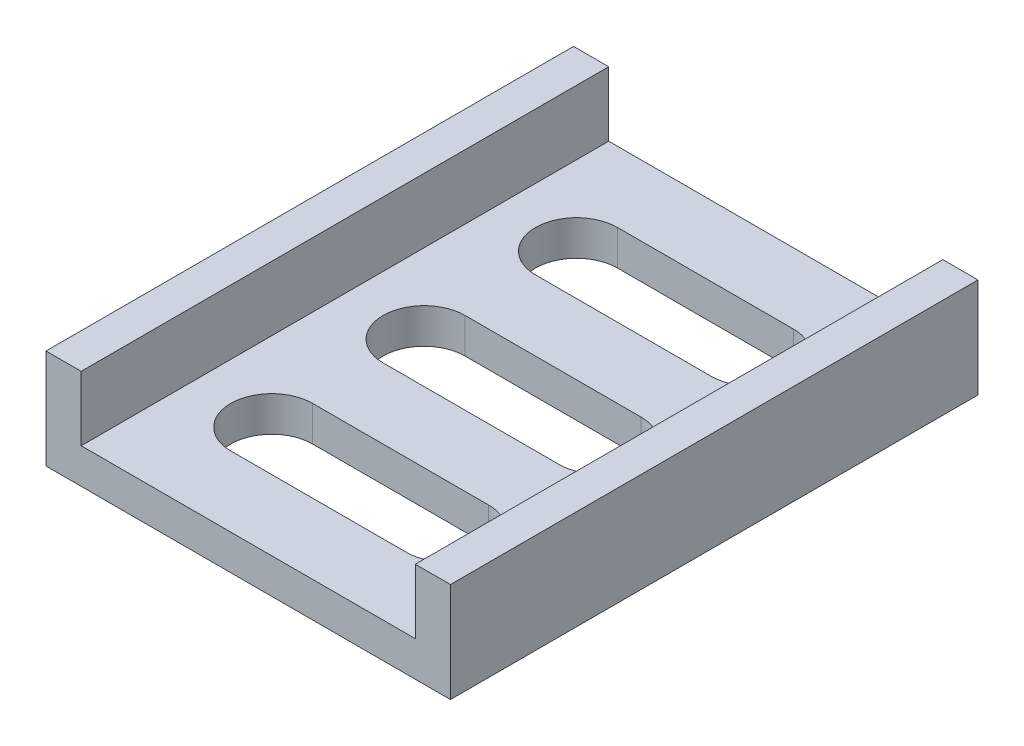
ISO-10303-21;
HEADER;
FILE_DESCRIPTION(('STEP AP214'),'2;1');
FILE_NAME('part.step','',(''),(''),'','','');
FILE_SCHEMA(('AUTOMOTIVE_DESIGN { 1 0 10303 214 1 1 1 1 }'));
ENDSEC;
DATA;
#1=APPLICATION_CONTEXT('core data for automotive mechanical design processes');
#2=APPLICATION_PROTOCOL_DEFINITION('international standard','automotive_design',2000,#1);
#3=PRODUCT_CONTEXT('',#1,'mechanical');
#4=PRODUCT('Part','Part','',(#3));
#5=PRODUCT_RELATED_PRODUCT_CATEGORY('part','',(#4));
#6=PRODUCT_DEFINITION_FORMATION('','',#4);
#7=PRODUCT_DEFINITION_CONTEXT('part definition',#1,'design');
#8=PRODUCT_DEFINITION('design','',#6,#7);
#9=PRODUCT_DEFINITION_SHAPE('','',#8);
#10=(LENGTH_UNIT() NAMED_UNIT(*) SI_UNIT(.MILLI.,.METRE.));
#11=(NAMED_UNIT(*) PLANE_ANGLE_UNIT() SI_UNIT($,.RADIAN.));
#12=(NAMED_UNIT(*) SI_UNIT($,.STERADIAN.) SOLID_ANGLE_UNIT());
#13=UNCERTAINTY_MEASURE_WITH_UNIT(LENGTH_MEASURE(1.E-05),#10,'distance_accuracy_value','');
#14=(GEOMETRIC_REPRESENTATION_CONTEXT(3) GLOBAL_UNCERTAINTY_ASSIGNED_CONTEXT((#13)) GLOBAL_UNIT_ASSIGNED_CONTEXT((#10,
#11,#12)) REPRESENTATION_CONTEXT('',''));
#15=CARTESIAN_POINT('',(0.,0.,0.));
#16=DIRECTION('',(0.,0.,1.));
#17=DIRECTION('',(1.,0.,0.));
#18=AXIS2_PLACEMENT_3D('',#15,#16,#17);
#19=CARTESIAN_POINT('',(17.25,0.,-22.5));
#20=DIRECTION('',(-1.,0.,0.));
#21=DIRECTION('',(0.,0.,1.));
#22=AXIS2_PLACEMENT_3D('',#19,#20,#21);
#23=PLANE('',#22);
#24=DIRECTION('',(0.,1.,0.));
#25=VECTOR('',#24,1.);
#26=CARTESIAN_POINT('',(17.25,4.25,-22.5));
#27=LINE('',#26,#25);
#28=CARTESIAN_POINT('',(17.25,0.,-22.5));
#29=VERTEX_POINT('',#28);
#30=CARTESIAN_POINT('',(17.25,8.5,-22.5));
#31=VERTEX_POINT('',#30);
#32=EDGE_CURVE('E270',#29,#31,#27,.T.);
#33=ORIENTED_EDGE('',*,*,#32,.T.);
#34=DIRECTION('',(0.,0.,1.));
#35=VECTOR('',#34,1.);
#36=CARTESIAN_POINT('',(17.25,8.5,0.));
#37=LINE('',#36,#35);
#38=CARTESIAN_POINT('',(17.25,8.5,22.5));
#39=VERTEX_POINT('',#38);
#40=EDGE_CURVE('E170',#31,#39,#37,.T.);
#41=ORIENTED_EDGE('',*,*,#40,.T.);
#42=DIRECTION('',(0.,-1.,0.));
#43=VECTOR('',#42,1.);
#44=CARTESIAN_POINT('',(17.25,4.25,22.5));
#45=LINE('',#44,#43);
#46=CARTESIAN_POINT('',(17.25,0.,22.5));
#47=VERTEX_POINT('',#46);
#48=EDGE_CURVE('E278',#39,#47,#45,.T.);
#49=ORIENTED_EDGE('',*,*,#48,.T.);
#50=DIRECTION('',(0.,0.,1.));
#51=VECTOR('',#50,1.);
#52=CARTESIAN_POINT('',(17.25,0.,0.));
#53=LINE('',#52,#51);
#54=EDGE_CURVE('E182',#29,#47,#53,.T.);
#55=ORIENTED_EDGE('',*,*,#54,.F.);
#56=EDGE_LOOP('',(#33,#41,#49,#55));
#57=FACE_BOUND('',#56,.T.);
#58=ADVANCED_FACE('F17',(#57),#23,.F.);
#59=CARTESIAN_POINT('',(-17.25,8.5,-22.5));
#60=DIRECTION('',(0.,1.,0.));
#61=DIRECTION('',(0.,0.,1.));
#62=AXIS2_PLACEMENT_3D('',#59,#60,#61);
#63=PLANE('',#62);
#64=DIRECTION('',(1.,0.,0.));
#65=VECTOR('',#64,1.);
#66=CARTESIAN_POINT('',(0.,8.5,22.5));
#67=LINE('',#66,#65);
#68=CARTESIAN_POINT('',(-17.25,8.5,22.5));
#69=VERTEX_POINT('',#68);
#70=CARTESIAN_POINT('',(-14.2499999955,8.5,22.5));
#71=VERTEX_POINT('',#70);
#72=EDGE_CURVE('E163',#69,#71,#67,.T.);
#73=ORIENTED_EDGE('',*,*,#72,.T.);
#74=DIRECTION('',(0.,0.,-1.));
#75=VECTOR('',#74,1.);
#76=CARTESIAN_POINT('',(-14.25,8.5,0.));
#77=LINE('',#76,#75);
#78=CARTESIAN_POINT('',(-14.24999999775,8.5,-22.5));
#79=VERTEX_POINT('',#78);
#80=EDGE_CURVE('E273',#71,#79,#77,.T.);
#81=ORIENTED_EDGE('',*,*,#80,.T.);
#82=DIRECTION('',(-1.,0.,0.));
#83=VECTOR('',#82,1.);
#84=CARTESIAN_POINT('',(0.,8.5,-22.5));
#85=LINE('',#84,#83);
#86=CARTESIAN_POINT('',(-17.25,8.5,-22.5));
#87=VERTEX_POINT('',#86);
#88=EDGE_CURVE('E166',#79,#87,#85,.T.);
#89=ORIENTED_EDGE('',*,*,#88,.T.);
#90=DIRECTION('',(0.,0.,1.));
#91=VECTOR('',#90,1.);
#92=CARTESIAN_POINT('',(-17.25,8.5,0.));
#93=LINE('',#92,#91);
#94=EDGE_CURVE('E161',#87,#69,#93,.T.);
#95=ORIENTED_EDGE('',*,*,#94,.T.);
#96=EDGE_LOOP('',(#73,#81,#89,#95));
#97=FACE_BOUND('',#96,.T.);
#98=ADVANCED_FACE('F162',(#97),#63,.T.);
#99=CARTESIAN_POINT('',(-17.25,0.,22.5));
#100=DIRECTION('',(1.,0.,0.));
#101=DIRECTION('',(0.,0.,-1.));
#102=AXIS2_PLACEMENT_3D('',#99,#100,#101);
#103=PLANE('',#102);
#104=DIRECTION('',(0.,1.,0.));
#105=VECTOR('',#104,1.);
#106=CARTESIAN_POINT('',(-17.25,4.25,22.5));
#107=LINE('',#106,#105);
#108=CARTESIAN_POINT('',(-17.25,0.,22.5));
#109=VERTEX_POINT('',#108);
#110=EDGE_CURVE('E156',#109,#69,#107,.T.);
#111=ORIENTED_EDGE('',*,*,#110,.T.);
#112=ORIENTED_EDGE('',*,*,#94,.F.);
#113=DIRECTION('',(0.,-1.,0.));
#114=VECTOR('',#113,1.);
#115=CARTESIAN_POINT('',(-17.25,4.25,-22.5));
#116=LINE('',#115,#114);
#117=CARTESIAN_POINT('',(-17.25,0.,-22.5));
#118=VERTEX_POINT('',#117);
#119=EDGE_CURVE('E262',#87,#118,#116,.T.);
#120=ORIENTED_EDGE('',*,*,#119,.T.);
#121=DIRECTION('',(0.,0.,-1.));
#122=VECTOR('',#121,1.);
#123=CARTESIAN_POINT('',(-17.25,0.,0.));
#124=LINE('',#123,#122);
#125=EDGE_CURVE('E179',#109,#118,#124,.T.);
#126=ORIENTED_EDGE('',*,*,#125,.F.);
#127=EDGE_LOOP('',(#111,#112,#120,#126));
#128=FACE_BOUND('',#127,.T.);
#129=ADVANCED_FACE('F178',(#128),#103,.F.);
#130=CARTESIAN_POINT('',(14.25,8.5,22.5));
#131=DIRECTION('',(0.,-1.,0.));
#132=DIRECTION('',(0.,0.,-1.));
#133=AXIS2_PLACEMENT_3D('',#130,#131,#132);
#134=PLANE('',#133);
#135=DIRECTION('',(0.,0.,1.));
#136=VECTOR('',#135,1.);
#137=CARTESIAN_POINT('',(14.25,8.5,0.));
#138=LINE('',#137,#136);
#139=CARTESIAN_POINT('',(14.2499999955,8.5,-22.5));
#140=VERTEX_POINT('',#139);
#141=CARTESIAN_POINT('',(14.24999999775,8.5,22.5));
#142=VERTEX_POINT('',#141);
#143=EDGE_CURVE('E253',#140,#142,#138,.T.);
#144=ORIENTED_EDGE('',*,*,#143,.T.);
#145=DIRECTION('',(1.,0.,0.));
#146=VECTOR('',#145,1.);
#147=CARTESIAN_POINT('',(0.,8.5,22.5));
#148=LINE('',#147,#146);
#149=EDGE_CURVE('E120',#142,#39,#148,.T.);
#150=ORIENTED_EDGE('',*,*,#149,.T.);
#151=ORIENTED_EDGE('',*,*,#40,.F.);
#152=DIRECTION('',(-1.,0.,0.));
#153=VECTOR('',#152,1.);
#154=CARTESIAN_POINT('',(0.,8.5,-22.5));
#155=LINE('',#154,#153);
#156=EDGE_CURVE('E268',#31,#140,#155,.T.);
#157=ORIENTED_EDGE('',*,*,#156,.T.);
#158=EDGE_LOOP('',(#144,#150,#151,#157));
#159=FACE_BOUND('',#158,.T.);
#160=ADVANCED_FACE('F281',(#159),#134,.F.);
#161=CARTESIAN_POINT('',(-17.25,0.,22.5));
#162=DIRECTION('',(0.,-1.,0.));
#163=DIRECTION('',(0.,0.,-1.));
#164=AXIS2_PLACEMENT_3D('',#161,#162,#163);
#165=PLANE('',#164);
#166=DIRECTION('',(-1.,0.,0.));
#167=VECTOR('',#166,1.);
#168=CARTESIAN_POINT('',(0.,0.,9.5));
#169=LINE('',#168,#167);
#170=CARTESIAN_POINT('',(7.5,0.,9.5));
#171=VERTEX_POINT('',#170);
#172=CARTESIAN_POINT('',(-7.50000000071786,0.,9.5));
#173=VERTEX_POINT('',#172);
#174=EDGE_CURVE('E192',#171,#173,#169,.T.);
#175=ORIENTED_EDGE('',*,*,#174,.T.);
#176=CARTESIAN_POINT('',(-7.5,0.,13.));
#177=DIRECTION('',(0.,1.,0.));
#178=DIRECTION('',(0.,0.,1.));
#179=AXIS2_PLACEMENT_3D('',#176,#177,#178);
#180=CIRCLE('',#179,3.5);
#181=CARTESIAN_POINT('',(-7.5,0.,16.5));
#182=VERTEX_POINT('',#181);
#183=EDGE_CURVE('E232',#182,#173,#180,.F.);
#184=ORIENTED_EDGE('',*,*,#183,.F.);
#185=DIRECTION('',(1.,0.,0.));
#186=VECTOR('',#185,1.);
#187=CARTESIAN_POINT('',(0.,0.,16.5));
#188=LINE('',#187,#186);
#189=CARTESIAN_POINT('',(7.5,0.,16.5));
#190=VERTEX_POINT('',#189);
#191=EDGE_CURVE('E186',#182,#190,#188,.T.);
#192=ORIENTED_EDGE('',*,*,#191,.T.);
#193=CARTESIAN_POINT('',(7.5,0.,13.));
#194=DIRECTION('',(0.,1.,0.));
#195=DIRECTION('',(0.,0.,1.));
#196=AXIS2_PLACEMENT_3D('',#193,#194,#195);
#197=CIRCLE('',#196,3.5);
#198=EDGE_CURVE('E200',#171,#190,#197,.F.);
#199=ORIENTED_EDGE('',*,*,#198,.F.);
#200=EDGE_LOOP('',(#175,#184,#192,#199));
#201=FACE_BOUND('',#200,.T.);
#202=DIRECTION('',(-1.,0.,0.));
#203=VECTOR('',#202,1.);
#204=CARTESIAN_POINT('',(0.,0.,-3.5));
#205=LINE('',#204,#203);
#206=CARTESIAN_POINT('',(7.5,0.,-3.5));
#207=VERTEX_POINT('',#206);
#208=CARTESIAN_POINT('',(-7.50000000071786,0.,-3.5));
#209=VERTEX_POINT('',#208);
#210=EDGE_CURVE('E202',#207,#209,#205,.T.);
#211=ORIENTED_EDGE('',*,*,#210,.T.);
#212=CARTESIAN_POINT('',(-7.5,0.,0.));
#213=DIRECTION('',(0.,1.,0.));
#214=DIRECTION('',(0.,0.,1.));
#215=AXIS2_PLACEMENT_3D('',#212,#213,#214);
#216=CIRCLE('',#215,3.5);
#217=CARTESIAN_POINT('',(-7.5,0.,3.5));
#218=VERTEX_POINT('',#217);
#219=EDGE_CURVE('E235',#218,#209,#216,.F.);
#220=ORIENTED_EDGE('',*,*,#219,.F.);
#221=DIRECTION('',(1.,0.,0.));
#222=VECTOR('',#221,1.);
#223=CARTESIAN_POINT('',(0.,0.,3.5));
#224=LINE('',#223,#222);
#225=CARTESIAN_POINT('',(7.5,0.,3.5));
#226=VERTEX_POINT('',#225);
#227=EDGE_CURVE('E197',#218,#226,#224,.T.);
#228=ORIENTED_EDGE('',*,*,#227,.T.);
#229=CARTESIAN_POINT('',(7.5,0.,0.));
#230=DIRECTION('',(0.,1.,0.));
#231=DIRECTION('',(0.,0.,1.));
#232=AXIS2_PLACEMENT_3D('',#229,#230,#231);
#233=CIRCLE('',#232,3.5);
#234=EDGE_CURVE('E238',#207,#226,#233,.F.);
#235=ORIENTED_EDGE('',*,*,#234,.F.);
#236=EDGE_LOOP('',(#211,#220,#228,#235));
#237=FACE_BOUND('',#236,.T.);
#238=CARTESIAN_POINT('',(-7.5,0.,-13.));
#239=DIRECTION('',(0.,1.,0.));
#240=DIRECTION('',(0.,0.,1.));
#241=AXIS2_PLACEMENT_3D('',#238,#239,#240);
#242=CIRCLE('',#241,3.5);
#243=CARTESIAN_POINT('',(-7.50000000031428,0.,-9.5));
#244=VERTEX_POINT('',#243);
#245=CARTESIAN_POINT('',(-7.50000000071786,0.,-16.5));
#246=VERTEX_POINT('',#245);
#247=EDGE_CURVE('E239',#244,#246,#242,.F.);
#248=ORIENTED_EDGE('',*,*,#247,.F.);
#249=DIRECTION('',(1.,0.,0.));
#250=VECTOR('',#249,1.);
#251=CARTESIAN_POINT('',(0.,0.,-9.5));
#252=LINE('',#251,#250);
#253=CARTESIAN_POINT('',(7.5,0.,-9.5));
#254=VERTEX_POINT('',#253);
#255=EDGE_CURVE('E207',#244,#254,#252,.T.);
#256=ORIENTED_EDGE('',*,*,#255,.T.);
#257=CARTESIAN_POINT('',(7.5,0.,-13.));
#258=DIRECTION('',(0.,1.,0.));
#259=DIRECTION('',(0.,0.,1.));
#260=AXIS2_PLACEMENT_3D('',#257,#258,#259);
#261=CIRCLE('',#260,3.5);
#262=CARTESIAN_POINT('',(7.5,0.,-16.5));
#263=VERTEX_POINT('',#262);
#264=EDGE_CURVE('E21',#263,#254,#261,.F.);
#265=ORIENTED_EDGE('',*,*,#264,.F.);
#266=DIRECTION('',(-1.,0.,0.));
#267=VECTOR('',#266,1.);
#268=CARTESIAN_POINT('',(0.,0.,-16.5));
#269=LINE('',#268,#267);
#270=EDGE_CURVE('E211',#263,#246,#269,.T.);
#271=ORIENTED_EDGE('',*,*,#270,.T.);
#272=EDGE_LOOP('',(#248,#256,#265,#271));
#273=FACE_BOUND('',#272,.T.);
#274=ORIENTED_EDGE('',*,*,#125,.T.);
#275=DIRECTION('',(1.,0.,0.));
#276=VECTOR('',#275,1.);
#277=CARTESIAN_POINT('',(0.,0.,-22.5));
#278=LINE('',#277,#276);
#279=EDGE_CURVE('E259',#118,#29,#278,.T.);
#280=ORIENTED_EDGE('',*,*,#279,.T.);
#281=ORIENTED_EDGE('',*,*,#54,.T.);
#282=DIRECTION('',(-1.,0.,0.));
#283=VECTOR('',#282,1.);
#284=CARTESIAN_POINT('',(0.,0.,22.5));
#285=LINE('',#284,#283);
#286=EDGE_CURVE('E276',#47,#109,#285,.T.);
#287=ORIENTED_EDGE('',*,*,#286,.T.);
#288=EDGE_LOOP('',(#274,#280,#281,#287));
#289=FACE_BOUND('',#288,.T.);
#290=ADVANCED_FACE('F352',(#201,#237,#273,#289),#165,.T.);
#291=CARTESIAN_POINT('',(17.25,0.,22.5));
#292=DIRECTION('',(0.,0.,-1.));
#293=DIRECTION('',(-1.,0.,0.));
#294=AXIS2_PLACEMENT_3D('',#291,#292,#293);
#295=PLANE('',#294);
#296=ORIENTED_EDGE('',*,*,#48,.F.);
#297=ORIENTED_EDGE('',*,*,#149,.F.);
#298=DIRECTION('',(0.,-1.,0.));
#299=VECTOR('',#298,1.);
#300=CARTESIAN_POINT('',(14.25,5.75,22.5));
#301=LINE('',#300,#299);
#302=CARTESIAN_POINT('',(14.2499999955,2.999999998,22.5));
#303=VERTEX_POINT('',#302);
#304=EDGE_CURVE('E210',#142,#303,#301,.T.);
#305=ORIENTED_EDGE('',*,*,#304,.T.);
#306=DIRECTION('',(-1.,0.,0.));
#307=VECTOR('',#306,1.);
#308=CARTESIAN_POINT('',(0.,3.,22.5));
#309=LINE('',#308,#307);
#310=CARTESIAN_POINT('',(-14.2499999955,2.999999998,22.5));
#311=VERTEX_POINT('',#310);
#312=EDGE_CURVE('E304',#303,#311,#309,.T.);
#313=ORIENTED_EDGE('',*,*,#312,.T.);
#314=DIRECTION('',(0.,1.,0.));
#315=VECTOR('',#314,1.);
#316=CARTESIAN_POINT('',(-14.25,5.75,22.5));
#317=LINE('',#316,#315);
#318=EDGE_CURVE('E176',#311,#71,#317,.T.);
#319=ORIENTED_EDGE('',*,*,#318,.T.);
#320=ORIENTED_EDGE('',*,*,#72,.F.);
#321=ORIENTED_EDGE('',*,*,#110,.F.);
#322=ORIENTED_EDGE('',*,*,#286,.F.);
#323=EDGE_LOOP('',(#296,#297,#305,#313,#319,#320,#321,#322));
#324=FACE_BOUND('',#323,.T.);
#325=ADVANCED_FACE('F173',(#324),#295,.F.);
#326=CARTESIAN_POINT('',(-14.25,3.,-22.5));
#327=DIRECTION('',(-1.,0.,0.));
#328=DIRECTION('',(0.,0.,1.));
#329=AXIS2_PLACEMENT_3D('',#326,#327,#328);
#330=PLANE('',#329);
#331=DIRECTION('',(0.,1.,0.));
#332=VECTOR('',#331,1.);
#333=CARTESIAN_POINT('',(-14.249999991,4.25,-22.5));
#334=LINE('',#333,#332);
#335=CARTESIAN_POINT('',(-14.24999999775,2.999999999,-22.5));
#336=VERTEX_POINT('',#335);
#337=EDGE_CURVE('E265',#336,#79,#334,.T.);
#338=ORIENTED_EDGE('',*,*,#337,.T.);
#339=ORIENTED_EDGE('',*,*,#80,.F.);
#340=ORIENTED_EDGE('',*,*,#318,.F.);
#341=DIRECTION('',(0.,0.,-1.));
#342=VECTOR('',#341,1.);
#343=CARTESIAN_POINT('',(-14.25,3.,0.));
#344=LINE('',#343,#342);
#345=EDGE_CURVE('E301',#311,#336,#344,.T.);
#346=ORIENTED_EDGE('',*,*,#345,.T.);
#347=EDGE_LOOP('',(#338,#339,#340,#346));
#348=FACE_BOUND('',#347,.T.);
#349=ADVANCED_FACE('F510',(#348),#330,.F.);
#350=CARTESIAN_POINT('',(-17.25,0.,-22.5));
#351=DIRECTION('',(0.,0.,1.));
#352=DIRECTION('',(1.,0.,0.));
#353=AXIS2_PLACEMENT_3D('',#350,#351,#352);
#354=PLANE('',#353);
#355=ORIENTED_EDGE('',*,*,#119,.F.);
#356=ORIENTED_EDGE('',*,*,#88,.F.);
#357=ORIENTED_EDGE('',*,*,#337,.F.);
#358=DIRECTION('',(1.,0.,0.));
#359=VECTOR('',#358,1.);
#360=CARTESIAN_POINT('',(0.,3.,-22.5));
#361=LINE('',#360,#359);
#362=CARTESIAN_POINT('',(14.2499999955,2.999999998,-22.5));
#363=VERTEX_POINT('',#362);
#364=EDGE_CURVE('E294',#336,#363,#361,.T.);
#365=ORIENTED_EDGE('',*,*,#364,.T.);
#366=DIRECTION('',(0.,1.,0.));
#367=VECTOR('',#366,1.);
#368=CARTESIAN_POINT('',(14.25,5.75,-22.5));
#369=LINE('',#368,#367);
#370=EDGE_CURVE('E256',#363,#140,#369,.T.);
#371=ORIENTED_EDGE('',*,*,#370,.T.);
#372=ORIENTED_EDGE('',*,*,#156,.F.);
#373=ORIENTED_EDGE('',*,*,#32,.F.);
#374=ORIENTED_EDGE('',*,*,#279,.F.);
#375=EDGE_LOOP('',(#355,#356,#357,#365,#371,#372,#373,#374));
#376=FACE_BOUND('',#375,.T.);
#377=ADVANCED_FACE('F291',(#376),#354,.F.);
#378=CARTESIAN_POINT('',(14.25,3.,22.5));
#379=DIRECTION('',(1.,0.,0.));
#380=DIRECTION('',(0.,0.,-1.));
#381=AXIS2_PLACEMENT_3D('',#378,#379,#380);
#382=PLANE('',#381);
#383=ORIENTED_EDGE('',*,*,#304,.F.);
#384=ORIENTED_EDGE('',*,*,#143,.F.);
#385=ORIENTED_EDGE('',*,*,#370,.F.);
#386=DIRECTION('',(0.,0.,1.));
#387=VECTOR('',#386,1.);
#388=CARTESIAN_POINT('',(14.25,3.,0.));
#389=LINE('',#388,#387);
#390=EDGE_CURVE('E300',#363,#303,#389,.T.);
#391=ORIENTED_EDGE('',*,*,#390,.T.);
#392=EDGE_LOOP('',(#383,#384,#385,#391));
#393=FACE_BOUND('',#392,.T.);
#394=ADVANCED_FACE('F286',(#393),#382,.F.);
#395=CARTESIAN_POINT('',(-7.5,0.,-9.5));
#396=DIRECTION('',(0.,0.,1.));
#397=DIRECTION('',(1.,0.,0.));
#398=AXIS2_PLACEMENT_3D('',#395,#396,#397);
#399=PLANE('',#398);
#400=DIRECTION('',(0.,1.,0.));
#401=VECTOR('',#400,1.);
#402=CARTESIAN_POINT('',(-7.50000000062855,1.5,-9.5));
#403=LINE('',#402,#401);
#404=CARTESIAN_POINT('',(-7.50000000031428,3.,-9.4999999975));
#405=VERTEX_POINT('',#404);
#406=EDGE_CURVE('E240',#405,#244,#403,.F.);
#407=ORIENTED_EDGE('',*,*,#406,.F.);
#408=DIRECTION('',(1.,0.,0.));
#409=VECTOR('',#408,1.);
#410=CARTESIAN_POINT('',(0.,3.,-9.499999995));
#411=LINE('',#410,#409);
#412=CARTESIAN_POINT('',(7.5,3.,-9.4999999975));
#413=VERTEX_POINT('',#412);
#414=EDGE_CURVE('E231',#405,#413,#411,.T.);
#415=ORIENTED_EDGE('',*,*,#414,.T.);
#416=DIRECTION('',(0.,-1.,0.));
#417=VECTOR('',#416,1.);
#418=CARTESIAN_POINT('',(7.5,1.5,-9.5));
#419=LINE('',#418,#417);
#420=EDGE_CURVE('E209',#254,#413,#419,.F.);
#421=ORIENTED_EDGE('',*,*,#420,.F.);
#422=ORIENTED_EDGE('',*,*,#255,.F.);
#423=EDGE_LOOP('',(#407,#415,#421,#422));
#424=FACE_BOUND('',#423,.T.);
#425=ADVANCED_FACE('F343',(#424),#399,.F.);
#426=CARTESIAN_POINT('',(7.5,0.,-13.));
#427=DIRECTION('',(0.,1.,0.));
#428=DIRECTION('',(0.,0.,1.));
#429=AXIS2_PLACEMENT_3D('',#426,#427,#428);
#430=CYLINDRICAL_SURFACE('',#429,3.5);
#431=DIRECTION('',(0.,-1.,0.));
#432=VECTOR('',#431,1.);
#433=CARTESIAN_POINT('',(7.5,1.5,-16.5));
#434=LINE('',#433,#432);
#435=CARTESIAN_POINT('',(7.5,3.,-16.5000000075));
#436=VERTEX_POINT('',#435);
#437=EDGE_CURVE('E214',#436,#263,#434,.T.);
#438=ORIENTED_EDGE('',*,*,#437,.T.);
#439=ORIENTED_EDGE('',*,*,#264,.T.);
#440=ORIENTED_EDGE('',*,*,#420,.T.);
#441=CARTESIAN_POINT('',(7.5,3.,-13.));
#442=DIRECTION('',(0.,1.,0.));
#443=DIRECTION('',(0.,0.,1.));
#444=AXIS2_PLACEMENT_3D('',#441,#442,#443);
#445=CIRCLE('',#444,3.5);
#446=EDGE_CURVE('E229',#413,#436,#445,.T.);
#447=ORIENTED_EDGE('',*,*,#446,.T.);
#448=EDGE_LOOP('',(#438,#439,#440,#447));
#449=FACE_BOUND('',#448,.T.);
#450=ADVANCED_FACE('F348',(#449),#430,.F.);
#451=CARTESIAN_POINT('',(7.5,0.,-16.5));
#452=DIRECTION('',(0.,0.,-1.));
#453=DIRECTION('',(-1.,0.,0.));
#454=AXIS2_PLACEMENT_3D('',#451,#452,#453);
#455=PLANE('',#454);
#456=DIRECTION('',(0.,-1.,0.));
#457=VECTOR('',#456,1.);
#458=CARTESIAN_POINT('',(-7.50000000143572,1.5,-16.5));
#459=LINE('',#458,#457);
#460=CARTESIAN_POINT('',(-7.50000000071786,3.,-16.5000000075));
#461=VERTEX_POINT('',#460);
#462=EDGE_CURVE('E213',#246,#461,#459,.F.);
#463=ORIENTED_EDGE('',*,*,#462,.F.);
#464=ORIENTED_EDGE('',*,*,#270,.F.);
#465=ORIENTED_EDGE('',*,*,#437,.F.);
#466=DIRECTION('',(-1.,0.,0.));
#467=VECTOR('',#466,1.);
#468=CARTESIAN_POINT('',(0.,3.,-16.500000015));
#469=LINE('',#468,#467);
#470=EDGE_CURVE('E228',#436,#461,#469,.T.);
#471=ORIENTED_EDGE('',*,*,#470,.T.);
#472=EDGE_LOOP('',(#463,#464,#465,#471));
#473=FACE_BOUND('',#472,.T.);
#474=ADVANCED_FACE('F351',(#473),#455,.F.);
#475=CARTESIAN_POINT('',(-7.5,0.,-13.));
#476=DIRECTION('',(0.,1.,0.));
#477=DIRECTION('',(0.,0.,1.));
#478=AXIS2_PLACEMENT_3D('',#475,#476,#477);
#479=CYLINDRICAL_SURFACE('',#478,3.5);
#480=ORIENTED_EDGE('',*,*,#247,.T.);
#481=ORIENTED_EDGE('',*,*,#462,.T.);
#482=CARTESIAN_POINT('',(-7.5,3.,-13.));
#483=DIRECTION('',(0.,1.,0.));
#484=DIRECTION('',(0.,0.,1.));
#485=AXIS2_PLACEMENT_3D('',#482,#483,#484);
#486=CIRCLE('',#485,3.5);
#487=EDGE_CURVE('E226',#461,#405,#486,.T.);
#488=ORIENTED_EDGE('',*,*,#487,.T.);
#489=ORIENTED_EDGE('',*,*,#406,.T.);
#490=EDGE_LOOP('',(#480,#481,#488,#489));
#491=FACE_BOUND('',#490,.T.);
#492=ADVANCED_FACE('F406',(#491),#479,.F.);
#493=CARTESIAN_POINT('',(7.5,0.,0.));
#494=DIRECTION('',(0.,1.,0.));
#495=DIRECTION('',(0.,0.,1.));
#496=AXIS2_PLACEMENT_3D('',#493,#494,#495);
#497=CYLINDRICAL_SURFACE('',#496,3.5);
#498=ORIENTED_EDGE('',*,*,#234,.T.);
#499=DIRECTION('',(0.,1.,0.));
#500=VECTOR('',#499,1.);
#501=CARTESIAN_POINT('',(7.5,1.5,3.5));
#502=LINE('',#501,#500);
#503=CARTESIAN_POINT('',(7.5,3.,3.500000005));
#504=VERTEX_POINT('',#503);
#505=EDGE_CURVE('E237',#226,#504,#502,.T.);
#506=ORIENTED_EDGE('',*,*,#505,.T.);
#507=CARTESIAN_POINT('',(7.5,3.,0.));
#508=DIRECTION('',(0.,1.,0.));
#509=DIRECTION('',(0.,0.,1.));
#510=AXIS2_PLACEMENT_3D('',#507,#508,#509);
#511=CIRCLE('',#510,3.5);
#512=CARTESIAN_POINT('',(7.5,3.,-3.500000005));
#513=VERTEX_POINT('',#512);
#514=EDGE_CURVE('E224',#504,#513,#511,.T.);
#515=ORIENTED_EDGE('',*,*,#514,.T.);
#516=DIRECTION('',(0.,-1.,0.));
#517=VECTOR('',#516,1.);
#518=CARTESIAN_POINT('',(7.5,1.5,-3.5));
#519=LINE('',#518,#517);
#520=EDGE_CURVE('E206',#513,#207,#519,.T.);
#521=ORIENTED_EDGE('',*,*,#520,.T.);
#522=EDGE_LOOP('',(#498,#506,#515,#521));
#523=FACE_BOUND('',#522,.T.);
#524=ADVANCED_FACE('F403',(#523),#497,.F.);
#525=CARTESIAN_POINT('',(7.5,0.,-3.5));
#526=DIRECTION('',(0.,0.,-1.));
#527=DIRECTION('',(-1.,0.,0.));
#528=AXIS2_PLACEMENT_3D('',#525,#526,#527);
#529=PLANE('',#528);
#530=ORIENTED_EDGE('',*,*,#520,.F.);
#531=DIRECTION('',(-1.,0.,0.));
#532=VECTOR('',#531,1.);
#533=CARTESIAN_POINT('',(0.,3.,-3.50000001));
#534=LINE('',#533,#532);
#535=CARTESIAN_POINT('',(-7.50000000071786,3.,-3.500000005));
#536=VERTEX_POINT('',#535);
#537=EDGE_CURVE('E223',#513,#536,#534,.T.);
#538=ORIENTED_EDGE('',*,*,#537,.T.);
#539=DIRECTION('',(0.,-1.,0.));
#540=VECTOR('',#539,1.);
#541=CARTESIAN_POINT('',(-7.50000000143572,1.5,-3.5));
#542=LINE('',#541,#540);
#543=EDGE_CURVE('E205',#209,#536,#542,.F.);
#544=ORIENTED_EDGE('',*,*,#543,.F.);
#545=ORIENTED_EDGE('',*,*,#210,.F.);
#546=EDGE_LOOP('',(#530,#538,#544,#545));
#547=FACE_BOUND('',#546,.T.);
#548=ADVANCED_FACE('F332',(#547),#529,.F.);
#549=CARTESIAN_POINT('',(-7.5,0.,0.));
#550=DIRECTION('',(0.,1.,0.));
#551=DIRECTION('',(0.,0.,1.));
#552=AXIS2_PLACEMENT_3D('',#549,#550,#551);
#553=CYLINDRICAL_SURFACE('',#552,3.5);
#554=DIRECTION('',(0.,-1.,0.));
#555=VECTOR('',#554,1.);
#556=CARTESIAN_POINT('',(-7.5,1.5,3.5));
#557=LINE('',#556,#555);
#558=CARTESIAN_POINT('',(-7.5,3.,3.500000005));
#559=VERTEX_POINT('',#558);
#560=EDGE_CURVE('E201',#559,#218,#557,.T.);
#561=ORIENTED_EDGE('',*,*,#560,.T.);
#562=ORIENTED_EDGE('',*,*,#219,.T.);
#563=ORIENTED_EDGE('',*,*,#543,.T.);
#564=CARTESIAN_POINT('',(-7.5,3.,0.));
#565=DIRECTION('',(0.,1.,0.));
#566=DIRECTION('',(0.,0.,1.));
#567=AXIS2_PLACEMENT_3D('',#564,#565,#566);
#568=CIRCLE('',#567,3.5);
#569=EDGE_CURVE('E221',#536,#559,#568,.T.);
#570=ORIENTED_EDGE('',*,*,#569,.T.);
#571=EDGE_LOOP('',(#561,#562,#563,#570));
#572=FACE_BOUND('',#571,.T.);
#573=ADVANCED_FACE('F321',(#572),#553,.F.);
#574=CARTESIAN_POINT('',(-7.5,0.,3.5));
#575=DIRECTION('',(0.,0.,1.));
#576=DIRECTION('',(1.,0.,0.));
#577=AXIS2_PLACEMENT_3D('',#574,#575,#576);
#578=PLANE('',#577);
#579=ORIENTED_EDGE('',*,*,#560,.F.);
#580=DIRECTION('',(1.,0.,0.));
#581=VECTOR('',#580,1.);
#582=CARTESIAN_POINT('',(0.,3.,3.50000001));
#583=LINE('',#582,#581);
#584=EDGE_CURVE('E220',#559,#504,#583,.T.);
#585=ORIENTED_EDGE('',*,*,#584,.T.);
#586=ORIENTED_EDGE('',*,*,#505,.F.);
#587=ORIENTED_EDGE('',*,*,#227,.F.);
#588=EDGE_LOOP('',(#579,#585,#586,#587));
#589=FACE_BOUND('',#588,.T.);
#590=ADVANCED_FACE('F390',(#589),#578,.F.);
#591=CARTESIAN_POINT('',(7.5,0.,13.));
#592=DIRECTION('',(0.,1.,0.));
#593=DIRECTION('',(0.,0.,1.));
#594=AXIS2_PLACEMENT_3D('',#591,#592,#593);
#595=CYLINDRICAL_SURFACE('',#594,3.5);
#596=ORIENTED_EDGE('',*,*,#198,.T.);
#597=DIRECTION('',(0.,1.,0.));
#598=VECTOR('',#597,1.);
#599=CARTESIAN_POINT('',(7.5,1.5,16.5));
#600=LINE('',#599,#598);
#601=CARTESIAN_POINT('',(7.5,3.,16.5000000075));
#602=VERTEX_POINT('',#601);
#603=EDGE_CURVE('E188',#190,#602,#600,.T.);
#604=ORIENTED_EDGE('',*,*,#603,.T.);
#605=CARTESIAN_POINT('',(7.5,3.,13.));
#606=DIRECTION('',(0.,1.,0.));
#607=DIRECTION('',(0.,0.,1.));
#608=AXIS2_PLACEMENT_3D('',#605,#606,#607);
#609=CIRCLE('',#608,3.5);
#610=CARTESIAN_POINT('',(7.5,3.,9.4999999975));
#611=VERTEX_POINT('',#610);
#612=EDGE_CURVE('E218',#602,#611,#609,.T.);
#613=ORIENTED_EDGE('',*,*,#612,.T.);
#614=DIRECTION('',(0.,-1.,0.));
#615=VECTOR('',#614,1.);
#616=CARTESIAN_POINT('',(7.5,1.5,9.5));
#617=LINE('',#616,#615);
#618=EDGE_CURVE('E196',#611,#171,#617,.T.);
#619=ORIENTED_EDGE('',*,*,#618,.T.);
#620=EDGE_LOOP('',(#596,#604,#613,#619));
#621=FACE_BOUND('',#620,.T.);
#622=ADVANCED_FACE('F388',(#621),#595,.F.);
#623=CARTESIAN_POINT('',(7.5,0.,9.5));
#624=DIRECTION('',(0.,0.,-1.));
#625=DIRECTION('',(-1.,0.,0.));
#626=AXIS2_PLACEMENT_3D('',#623,#624,#625);
#627=PLANE('',#626);
#628=ORIENTED_EDGE('',*,*,#618,.F.);
#629=DIRECTION('',(-1.,0.,0.));
#630=VECTOR('',#629,1.);
#631=CARTESIAN_POINT('',(0.,3.,9.49999999499999));
#632=LINE('',#631,#630);
#633=CARTESIAN_POINT('',(-7.50000000071786,3.,9.4999999975));
#634=VERTEX_POINT('',#633);
#635=EDGE_CURVE('E217',#611,#634,#632,.T.);
#636=ORIENTED_EDGE('',*,*,#635,.T.);
#637=DIRECTION('',(0.,-1.,0.));
#638=VECTOR('',#637,1.);
#639=CARTESIAN_POINT('',(-7.50000000143572,1.5,9.5));
#640=LINE('',#639,#638);
#641=EDGE_CURVE('E195',#173,#634,#640,.F.);
#642=ORIENTED_EDGE('',*,*,#641,.F.);
#643=ORIENTED_EDGE('',*,*,#174,.F.);
#644=EDGE_LOOP('',(#628,#636,#642,#643));
#645=FACE_BOUND('',#644,.T.);
#646=ADVANCED_FACE('F386',(#645),#627,.F.);
#647=CARTESIAN_POINT('',(-7.5,0.,13.));
#648=DIRECTION('',(0.,1.,0.));
#649=DIRECTION('',(0.,0.,1.));
#650=AXIS2_PLACEMENT_3D('',#647,#648,#649);
#651=CYLINDRICAL_SURFACE('',#650,3.5);
#652=DIRECTION('',(0.,-1.,0.));
#653=VECTOR('',#652,1.);
#654=CARTESIAN_POINT('',(-7.5,1.5,16.5));
#655=LINE('',#654,#653);
#656=CARTESIAN_POINT('',(-7.5,3.,16.5000000075));
#657=VERTEX_POINT('',#656);
#658=EDGE_CURVE('E189',#657,#182,#655,.T.);
#659=ORIENTED_EDGE('',*,*,#658,.T.);
#660=ORIENTED_EDGE('',*,*,#183,.T.);
#661=ORIENTED_EDGE('',*,*,#641,.T.);
#662=CARTESIAN_POINT('',(-7.5,3.,13.));
#663=DIRECTION('',(0.,1.,0.));
#664=DIRECTION('',(0.,0.,1.));
#665=AXIS2_PLACEMENT_3D('',#662,#663,#664);
#666=CIRCLE('',#665,3.5);
#667=EDGE_CURVE('E27',#634,#657,#666,.T.);
#668=ORIENTED_EDGE('',*,*,#667,.T.);
#669=EDGE_LOOP('',(#659,#660,#661,#668));
#670=FACE_BOUND('',#669,.T.);
#671=ADVANCED_FACE('F374',(#670),#651,.F.);
#672=CARTESIAN_POINT('',(-7.5,0.,16.5));
#673=DIRECTION('',(0.,0.,1.));
#674=DIRECTION('',(1.,0.,0.));
#675=AXIS2_PLACEMENT_3D('',#672,#673,#674);
#676=PLANE('',#675);
#677=ORIENTED_EDGE('',*,*,#603,.F.);
#678=ORIENTED_EDGE('',*,*,#191,.F.);
#679=ORIENTED_EDGE('',*,*,#658,.F.);
#680=DIRECTION('',(1.,0.,0.));
#681=VECTOR('',#680,1.);
#682=CARTESIAN_POINT('',(0.,3.,16.500000015));
#683=LINE('',#682,#681);
#684=EDGE_CURVE('E11',#657,#602,#683,.T.);
#685=ORIENTED_EDGE('',*,*,#684,.T.);
#686=EDGE_LOOP('',(#677,#678,#679,#685));
#687=FACE_BOUND('',#686,.T.);
#688=ADVANCED_FACE('F369',(#687),#676,.F.);
#689=CARTESIAN_POINT('',(-14.25,3.,22.5));
#690=DIRECTION('',(0.,-1.,0.));
#691=DIRECTION('',(0.,0.,-1.));
#692=AXIS2_PLACEMENT_3D('',#689,#690,#691);
#693=PLANE('',#692);
#694=ORIENTED_EDGE('',*,*,#684,.F.);
#695=ORIENTED_EDGE('',*,*,#667,.F.);
#696=ORIENTED_EDGE('',*,*,#635,.F.);
#697=ORIENTED_EDGE('',*,*,#612,.F.);
#698=EDGE_LOOP('',(#694,#695,#696,#697));
#699=FACE_BOUND('',#698,.T.);
#700=ORIENTED_EDGE('',*,*,#584,.F.);
#701=ORIENTED_EDGE('',*,*,#569,.F.);
#702=ORIENTED_EDGE('',*,*,#537,.F.);
#703=ORIENTED_EDGE('',*,*,#514,.F.);
#704=EDGE_LOOP('',(#700,#701,#702,#703));
#705=FACE_BOUND('',#704,.T.);
#706=ORIENTED_EDGE('',*,*,#487,.F.);
#707=ORIENTED_EDGE('',*,*,#470,.F.);
#708=ORIENTED_EDGE('',*,*,#446,.F.);
#709=ORIENTED_EDGE('',*,*,#414,.F.);
#710=EDGE_LOOP('',(#706,#707,#708,#709));
#711=FACE_BOUND('',#710,.T.);
#712=ORIENTED_EDGE('',*,*,#364,.F.);
#713=ORIENTED_EDGE('',*,*,#345,.F.);
#714=ORIENTED_EDGE('',*,*,#312,.F.);
#715=ORIENTED_EDGE('',*,*,#390,.F.);
#716=EDGE_LOOP('',(#712,#713,#714,#715));
#717=FACE_BOUND('',#716,.T.);
#718=ADVANCED_FACE('F19',(#699,#705,#711,#717),#693,.F.);
#719=CLOSED_SHELL('',(#58,#98,#129,#160,#290,#325,#349,#377,#394,#425,#450,#474,#492,#524,#548,
#573,#590,#622,#646,#671,#688,#718));
#720=MANIFOLD_SOLID_BREP('B1',#719);
#721=ADVANCED_BREP_SHAPE_REPRESENTATION('',(#18,#720),#14);
#722=SHAPE_DEFINITION_REPRESENTATION(#9,#721);
ENDSEC;
END-ISO-10303-21;
